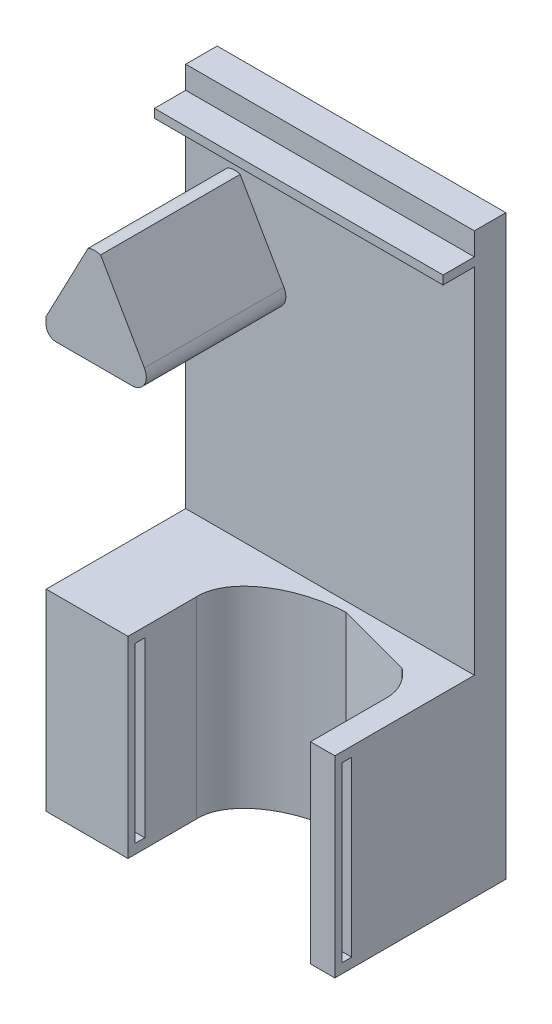
ISO-10303-21;
HEADER;
FILE_DESCRIPTION(('STEP AP214'),'2;1');
FILE_NAME('part.step','',(''),(''),'','','');
FILE_SCHEMA(('AUTOMOTIVE_DESIGN { 1 0 10303 214 1 1 1 1 }'));
ENDSEC;
DATA;
#1=APPLICATION_CONTEXT('core data for automotive mechanical design processes');
#2=APPLICATION_PROTOCOL_DEFINITION('international standard','automotive_design',2000,#1);
#3=PRODUCT_CONTEXT('',#1,'mechanical');
#4=PRODUCT('Part','Part','',(#3));
#5=PRODUCT_RELATED_PRODUCT_CATEGORY('part','',(#4));
#6=PRODUCT_DEFINITION_FORMATION('','',#4);
#7=PRODUCT_DEFINITION_CONTEXT('part definition',#1,'design');
#8=PRODUCT_DEFINITION('design','',#6,#7);
#9=PRODUCT_DEFINITION_SHAPE('','',#8);
#10=(LENGTH_UNIT() NAMED_UNIT(*) SI_UNIT(.MILLI.,.METRE.));
#11=(NAMED_UNIT(*) PLANE_ANGLE_UNIT() SI_UNIT($,.RADIAN.));
#12=(NAMED_UNIT(*) SI_UNIT($,.STERADIAN.) SOLID_ANGLE_UNIT());
#13=UNCERTAINTY_MEASURE_WITH_UNIT(LENGTH_MEASURE(1.E-05),#10,'distance_accuracy_value','');
#14=(GEOMETRIC_REPRESENTATION_CONTEXT(3) GLOBAL_UNCERTAINTY_ASSIGNED_CONTEXT((#13)) GLOBAL_UNIT_ASSIGNED_CONTEXT((#10,
#11,#12)) REPRESENTATION_CONTEXT('',''));
#15=CARTESIAN_POINT('',(0.,0.,0.));
#16=DIRECTION('',(0.,0.,1.));
#17=DIRECTION('',(1.,0.,0.));
#18=AXIS2_PLACEMENT_3D('',#15,#16,#17);
#19=CARTESIAN_POINT('',(0.,0.,6.54));
#20=DIRECTION('',(0.,0.,1.));
#21=DIRECTION('',(1.,0.,0.));
#22=AXIS2_PLACEMENT_3D('',#19,#20,#21);
#23=PLANE('',#22);
#24=DIRECTION('',(0.,1.,0.));
#25=VECTOR('',#24,1.);
#26=CARTESIAN_POINT('',(30.,60.,6.54));
#27=LINE('',#26,#25);
#28=CARTESIAN_POINT('',(30.,-20.,6.54));
#29=VERTEX_POINT('',#28);
#30=CARTESIAN_POINT('',(30.,53.5,6.54));
#31=VERTEX_POINT('',#30);
#32=EDGE_CURVE('E499',#29,#31,#27,.T.);
#33=ORIENTED_EDGE('',*,*,#32,.T.);
#34=DIRECTION('',(1.,0.,0.));
#35=VECTOR('',#34,1.);
#36=CARTESIAN_POINT('',(-30.,53.5,6.54));
#37=LINE('',#36,#35);
#38=CARTESIAN_POINT('',(-30.,53.5,6.54));
#39=VERTEX_POINT('',#38);
#40=EDGE_CURVE('E552',#39,#31,#37,.T.);
#41=ORIENTED_EDGE('',*,*,#40,.F.);
#42=DIRECTION('',(0.,-1.,0.));
#43=VECTOR('',#42,1.);
#44=CARTESIAN_POINT('',(-30.,60.,6.54));
#45=LINE('',#44,#43);
#46=CARTESIAN_POINT('',(-30.,29.1153741192558,6.54));
#47=VERTEX_POINT('',#46);
#48=EDGE_CURVE('E261',#39,#47,#45,.T.);
#49=ORIENTED_EDGE('',*,*,#48,.T.);
#50=DIRECTION('',(-0.464680084135932,-0.885478638594643,0.));
#51=VECTOR('',#50,1.);
#52=CARTESIAN_POINT('',(-21.2949868638054,45.7033524810124,6.54));
#53=LINE('',#52,#51);
#54=CARTESIAN_POINT('',(-21.2949868638054,45.7033524810124,6.54));
#55=VERTEX_POINT('',#54);
#56=EDGE_CURVE('E274',#55,#47,#53,.T.);
#57=ORIENTED_EDGE('',*,*,#56,.F.);
#58=CARTESIAN_POINT('',(-19.8396331656599,42.3250381747463,6.54));
#59=DIRECTION('',(0.,0.,1.));
#60=DIRECTION('',(-1.,0.,0.));
#61=AXIS2_PLACEMENT_3D('',#58,#59,#60);
#62=CIRCLE('',#61,3.67845917995946);
#63=CARTESIAN_POINT('',(-18.6840948980722,45.8172857677398,6.54));
#64=VERTEX_POINT('',#63);
#65=EDGE_CURVE('E284',#64,#55,#62,.T.);
#66=ORIENTED_EDGE('',*,*,#65,.F.);
#67=DIRECTION('',(-0.499150293138472,0.866515426786955,0.));
#68=VECTOR('',#67,1.);
#69=CARTESIAN_POINT('',(-7.,25.5339189814287,6.54));
#70=LINE('',#69,#68);
#71=CARTESIAN_POINT('',(-9.59072586065801,30.0313698608441,6.54));
#72=VERTEX_POINT('',#71);
#73=EDGE_CURVE('E265',#72,#64,#70,.T.);
#74=ORIENTED_EDGE('',*,*,#73,.F.);
#75=CARTESIAN_POINT('',(-12.1902721410189,28.5339189814287,6.54));
#76=DIRECTION('',(0.,0.,1.));
#77=DIRECTION('',(1.,0.,0.));
#78=AXIS2_PLACEMENT_3D('',#75,#76,#77);
#79=CIRCLE('',#78,3.);
#80=CARTESIAN_POINT('',(-12.1902721410189,25.5339189814287,6.54));
#81=VERTEX_POINT('',#80);
#82=EDGE_CURVE('E448',#72,#81,#79,.F.);
#83=ORIENTED_EDGE('',*,*,#82,.T.);
#84=DIRECTION('',(1.,0.,0.));
#85=VECTOR('',#84,1.);
#86=CARTESIAN_POINT('',(-30.,25.5339189814287,6.54));
#87=LINE('',#86,#85);
#88=CARTESIAN_POINT('',(-28.,25.5339189814287,6.54));
#89=VERTEX_POINT('',#88);
#90=EDGE_CURVE('E263',#89,#81,#87,.T.);
#91=ORIENTED_EDGE('',*,*,#90,.F.);
#92=CARTESIAN_POINT('',(-28.,27.5339189814287,6.54));
#93=DIRECTION('',(0.,0.,1.));
#94=DIRECTION('',(1.,0.,0.));
#95=AXIS2_PLACEMENT_3D('',#92,#93,#94);
#96=CIRCLE('',#95,2.);
#97=CARTESIAN_POINT('',(-30.,27.5339189814287,6.54));
#98=VERTEX_POINT('',#97);
#99=EDGE_CURVE('E12',#89,#98,#96,.F.);
#100=ORIENTED_EDGE('',*,*,#99,.T.);
#101=CARTESIAN_POINT('',(-30.,-20.,6.54));
#102=VERTEX_POINT('',#101);
#103=EDGE_CURVE('E51',#98,#102,#45,.T.);
#104=ORIENTED_EDGE('',*,*,#103,.T.);
#105=DIRECTION('',(-1.,0.,0.));
#106=VECTOR('',#105,1.);
#107=CARTESIAN_POINT('',(-30.,-20.,6.54));
#108=LINE('',#107,#106);
#109=EDGE_CURVE('E506',#29,#102,#108,.T.);
#110=ORIENTED_EDGE('',*,*,#109,.F.);
#111=EDGE_LOOP('',(#33,#41,#49,#57,#66,#74,#83,#91,#100,#104,#110));
#112=FACE_BOUND('',#111,.T.);
#113=ADVANCED_FACE('F36',(#112),#23,.T.);
#114=CARTESIAN_POINT('',(-30.,60.,6.54));
#115=VERTEX_POINT('',#114);
#116=CARTESIAN_POINT('',(-30.,55.3,6.54));
#117=VERTEX_POINT('',#116);
#118=EDGE_CURVE('E484',#115,#117,#45,.T.);
#119=ORIENTED_EDGE('',*,*,#118,.T.);
#120=DIRECTION('',(-1.,0.,0.));
#121=VECTOR('',#120,1.);
#122=CARTESIAN_POINT('',(-30.,55.3,6.54));
#123=LINE('',#122,#121);
#124=CARTESIAN_POINT('',(30.,55.3,6.54));
#125=VERTEX_POINT('',#124);
#126=EDGE_CURVE('E257',#125,#117,#123,.T.);
#127=ORIENTED_EDGE('',*,*,#126,.F.);
#128=CARTESIAN_POINT('',(30.,60.,6.54));
#129=VERTEX_POINT('',#128);
#130=EDGE_CURVE('E487',#125,#129,#27,.T.);
#131=ORIENTED_EDGE('',*,*,#130,.T.);
#132=DIRECTION('',(-1.,0.,0.));
#133=VECTOR('',#132,1.);
#134=CARTESIAN_POINT('',(-30.,60.,6.54));
#135=LINE('',#134,#133);
#136=EDGE_CURVE('E497',#129,#115,#135,.T.);
#137=ORIENTED_EDGE('',*,*,#136,.T.);
#138=EDGE_LOOP('',(#119,#127,#131,#137));
#139=FACE_BOUND('',#138,.T.);
#140=ADVANCED_FACE('F411',(#139),#23,.T.);
#141=CARTESIAN_POINT('',(-30.,-60.,6.54));
#142=DIRECTION('',(0.,1.,0.));
#143=DIRECTION('',(0.,0.,1.));
#144=AXIS2_PLACEMENT_3D('',#141,#142,#143);
#145=PLANE('',#144);
#146=DIRECTION('',(0.,0.,1.));
#147=VECTOR('',#146,1.);
#148=CARTESIAN_POINT('',(24.9445377,-60.,-0.001000000000001));
#149=LINE('',#148,#147);
#150=CARTESIAN_POINT('',(24.9445377,-60.,20.0760263546735));
#151=VERTEX_POINT('',#150);
#152=CARTESIAN_POINT('',(24.9445377,-60.,35.54));
#153=VERTEX_POINT('',#152);
#154=EDGE_CURVE('E373',#151,#153,#149,.T.);
#155=ORIENTED_EDGE('',*,*,#154,.F.);
#156=CARTESIAN_POINT('',(5.97226884999997,-60.,20.3091736323044));
#157=DIRECTION('',(0.,1.,0.));
#158=DIRECTION('',(0.998540465789473,0.,-0.0540086861619702));
#159=AXIS2_PLACEMENT_3D('',#156,#157,#158);
#160=ELLIPSE('',#159,19.,11.8);
#161=CARTESIAN_POINT('',(21.291300905005,-60.,12.8258124379132));
#162=VERTEX_POINT('',#161);
#163=EDGE_CURVE('E381',#162,#151,#160,.F.);
#164=ORIENTED_EDGE('',*,*,#163,.F.);
#165=DIRECTION('',(-0.96556287339124,0.,-0.260169824400239));
#166=VECTOR('',#165,1.);
#167=CARTESIAN_POINT('',(5.33496635328872,-60.,8.52639613598862));
#168=LINE('',#167,#166);
#169=CARTESIAN_POINT('',(5.33496635328871,-60.,8.52639613598862));
#170=VERTEX_POINT('',#169);
#171=EDGE_CURVE('E509',#162,#170,#168,.T.);
#172=ORIENTED_EDGE('',*,*,#171,.T.);
#173=CARTESIAN_POINT('',(-13.,-60.,21.3353386693828));
#174=VERTEX_POINT('',#173);
#175=EDGE_CURVE('E380',#174,#170,#160,.F.);
#176=ORIENTED_EDGE('',*,*,#175,.F.);
#177=DIRECTION('',(0.,0.,1.));
#178=VECTOR('',#177,1.);
#179=CARTESIAN_POINT('',(-13.,-60.,-0.001000000000001));
#180=LINE('',#179,#178);
#181=CARTESIAN_POINT('',(-13.,-60.,35.54));
#182=VERTEX_POINT('',#181);
#183=EDGE_CURVE('E370',#174,#182,#180,.T.);
#184=ORIENTED_EDGE('',*,*,#183,.T.);
#185=DIRECTION('',(1.,0.,0.));
#186=VECTOR('',#185,1.);
#187=CARTESIAN_POINT('',(-30.,-60.,35.54));
#188=LINE('',#187,#186);
#189=CARTESIAN_POINT('',(-30.,-60.,35.54));
#190=VERTEX_POINT('',#189);
#191=EDGE_CURVE('E515',#190,#182,#188,.T.);
#192=ORIENTED_EDGE('',*,*,#191,.F.);
#193=DIRECTION('',(0.,0.,-1.));
#194=VECTOR('',#193,1.);
#195=CARTESIAN_POINT('',(-30.,-60.,6.54));
#196=LINE('',#195,#194);
#197=CARTESIAN_POINT('',(-30.,-60.,0.));
#198=VERTEX_POINT('',#197);
#199=EDGE_CURVE('E478',#190,#198,#196,.T.);
#200=ORIENTED_EDGE('',*,*,#199,.T.);
#201=DIRECTION('',(1.,0.,0.));
#202=VECTOR('',#201,1.);
#203=CARTESIAN_POINT('',(-30.,-60.,0.));
#204=LINE('',#203,#202);
#205=CARTESIAN_POINT('',(30.,-60.,0.));
#206=VERTEX_POINT('',#205);
#207=EDGE_CURVE('E485',#198,#206,#204,.T.);
#208=ORIENTED_EDGE('',*,*,#207,.T.);
#209=DIRECTION('',(0.,0.,-1.));
#210=VECTOR('',#209,1.);
#211=CARTESIAN_POINT('',(30.,-60.,6.54));
#212=LINE('',#211,#210);
#213=CARTESIAN_POINT('',(30.,-60.,35.54));
#214=VERTEX_POINT('',#213);
#215=EDGE_CURVE('E481',#214,#206,#212,.T.);
#216=ORIENTED_EDGE('',*,*,#215,.F.);
#217=EDGE_CURVE('E518',#153,#214,#188,.T.);
#218=ORIENTED_EDGE('',*,*,#217,.F.);
#219=EDGE_LOOP('',(#155,#164,#172,#176,#184,#192,#200,#208,#216,#218));
#220=FACE_BOUND('',#219,.T.);
#221=ADVANCED_FACE('F407',(#220),#145,.F.);
#222=CARTESIAN_POINT('',(-30.,-20.,35.54));
#223=DIRECTION('',(0.,-1.,0.));
#224=DIRECTION('',(0.,0.,-1.));
#225=AXIS2_PLACEMENT_3D('',#222,#223,#224);
#226=PLANE('',#225);
#227=DIRECTION('',(0.,0.,1.));
#228=VECTOR('',#227,1.);
#229=CARTESIAN_POINT('',(24.9445377,-20.,-0.001000000000001));
#230=LINE('',#229,#228);
#231=CARTESIAN_POINT('',(24.9445377,-20.,20.0760263546737));
#232=VERTEX_POINT('',#231);
#233=CARTESIAN_POINT('',(24.9445377,-20.,35.54));
#234=VERTEX_POINT('',#233);
#235=EDGE_CURVE('E375',#232,#234,#230,.T.);
#236=ORIENTED_EDGE('',*,*,#235,.T.);
#237=DIRECTION('',(-1.,0.,0.));
#238=VECTOR('',#237,1.);
#239=CARTESIAN_POINT('',(-30.,-20.,35.54));
#240=LINE('',#239,#238);
#241=CARTESIAN_POINT('',(30.,-20.,35.54));
#242=VERTEX_POINT('',#241);
#243=EDGE_CURVE('E505',#242,#234,#240,.T.);
#244=ORIENTED_EDGE('',*,*,#243,.F.);
#245=DIRECTION('',(0.,0.,-1.));
#246=VECTOR('',#245,1.);
#247=CARTESIAN_POINT('',(30.,-20.,35.54));
#248=LINE('',#247,#246);
#249=EDGE_CURVE('E495',#242,#29,#248,.T.);
#250=ORIENTED_EDGE('',*,*,#249,.T.);
#251=ORIENTED_EDGE('',*,*,#109,.T.);
#252=DIRECTION('',(0.,0.,-1.));
#253=VECTOR('',#252,1.);
#254=CARTESIAN_POINT('',(-30.,-20.,35.54));
#255=LINE('',#254,#253);
#256=CARTESIAN_POINT('',(-30.,-20.,35.54));
#257=VERTEX_POINT('',#256);
#258=EDGE_CURVE('E503',#257,#102,#255,.T.);
#259=ORIENTED_EDGE('',*,*,#258,.F.);
#260=CARTESIAN_POINT('',(-13.,-20.,35.54));
#261=VERTEX_POINT('',#260);
#262=EDGE_CURVE('E512',#261,#257,#240,.T.);
#263=ORIENTED_EDGE('',*,*,#262,.F.);
#264=DIRECTION('',(0.,0.,1.));
#265=VECTOR('',#264,1.);
#266=CARTESIAN_POINT('',(-13.,-20.,-0.001000000000001));
#267=LINE('',#266,#265);
#268=CARTESIAN_POINT('',(-13.,-20.,21.3353386693828));
#269=VERTEX_POINT('',#268);
#270=EDGE_CURVE('E368',#269,#261,#267,.T.);
#271=ORIENTED_EDGE('',*,*,#270,.F.);
#272=CARTESIAN_POINT('',(5.97226884999997,-20.,20.3091736323044));
#273=DIRECTION('',(0.,1.,0.));
#274=DIRECTION('',(0.998540465789473,0.,-0.0540086861619702));
#275=AXIS2_PLACEMENT_3D('',#272,#273,#274);
#276=ELLIPSE('',#275,19.,11.8);
#277=CARTESIAN_POINT('',(5.33496635328872,-20.,8.52639613598862));
#278=VERTEX_POINT('',#277);
#279=EDGE_CURVE('E387',#278,#269,#276,.T.);
#280=ORIENTED_EDGE('',*,*,#279,.F.);
#281=DIRECTION('',(0.965562873391241,0.,0.260169824400239));
#282=VECTOR('',#281,1.);
#283=CARTESIAN_POINT('',(5.33496635328872,-20.,8.52639613598862));
#284=LINE('',#283,#282);
#285=CARTESIAN_POINT('',(21.291300905005,-20.,12.8258124379133));
#286=VERTEX_POINT('',#285);
#287=EDGE_CURVE('E527',#278,#286,#284,.T.);
#288=ORIENTED_EDGE('',*,*,#287,.T.);
#289=EDGE_CURVE('E384',#232,#286,#276,.T.);
#290=ORIENTED_EDGE('',*,*,#289,.F.);
#291=EDGE_LOOP('',(#236,#244,#250,#251,#259,#263,#271,#280,#288,#290));
#292=FACE_BOUND('',#291,.T.);
#293=ADVANCED_FACE('F404',(#292),#226,.F.);
#294=CARTESIAN_POINT('',(0.,0.,35.54));
#295=DIRECTION('',(0.,0.,1.));
#296=DIRECTION('',(1.,0.,0.));
#297=AXIS2_PLACEMENT_3D('',#294,#295,#296);
#298=PLANE('',#297);
#299=ORIENTED_EDGE('',*,*,#243,.T.);
#300=DIRECTION('',(0.,-1.,0.));
#301=VECTOR('',#300,1.);
#302=CARTESIAN_POINT('',(24.9445377,-20.,35.54));
#303=LINE('',#302,#301);
#304=EDGE_CURVE('E363',#234,#153,#303,.T.);
#305=ORIENTED_EDGE('',*,*,#304,.T.);
#306=ORIENTED_EDGE('',*,*,#217,.T.);
#307=DIRECTION('',(0.,1.,0.));
#308=VECTOR('',#307,1.);
#309=CARTESIAN_POINT('',(30.,-20.,35.54));
#310=LINE('',#309,#308);
#311=EDGE_CURVE('E513',#214,#242,#310,.T.);
#312=ORIENTED_EDGE('',*,*,#311,.T.);
#313=EDGE_LOOP('',(#299,#305,#306,#312));
#314=FACE_BOUND('',#313,.T.);
#315=ADVANCED_FACE('F403',(#314),#298,.T.);
#316=CARTESIAN_POINT('',(5.97226884999997,-60.001,20.3091736323044));
#317=DIRECTION('',(0.,1.,0.));
#318=DIRECTION('',(0.998540465789473,0.,-0.0540086861619702));
#319=AXIS2_PLACEMENT_3D('',#316,#317,#318);
#320=ELLIPSE('',#319,19.,11.8);
#321=DIRECTION('',(0.,1.,0.));
#322=VECTOR('',#321,1.);
#323=SURFACE_OF_LINEAR_EXTRUSION('',#320,#322);
#324=DIRECTION('',(0.,1.,0.));
#325=VECTOR('',#324,1.);
#326=CARTESIAN_POINT('',(24.9445377,-40.,20.0760263546737));
#327=LINE('',#326,#325);
#328=EDGE_CURVE('E354',#151,#232,#327,.T.);
#329=ORIENTED_EDGE('',*,*,#328,.T.);
#330=ORIENTED_EDGE('',*,*,#289,.T.);
#331=DIRECTION('',(0.,1.,0.));
#332=VECTOR('',#331,1.);
#333=CARTESIAN_POINT('',(21.291300905005,-60.001,12.8258124379132));
#334=LINE('',#333,#332);
#335=EDGE_CURVE('E524',#162,#286,#334,.T.);
#336=ORIENTED_EDGE('',*,*,#335,.F.);
#337=ORIENTED_EDGE('',*,*,#163,.T.);
#338=EDGE_LOOP('',(#329,#330,#336,#337));
#339=FACE_BOUND('',#338,.T.);
#340=ADVANCED_FACE('F397',(#339),#323,.F.);
#341=CARTESIAN_POINT('',(30.,60.,6.54));
#342=DIRECTION('',(-1.,0.,0.));
#343=DIRECTION('',(0.,-1.,0.));
#344=AXIS2_PLACEMENT_3D('',#341,#342,#343);
#345=PLANE('',#344);
#346=DIRECTION('',(0.,0.,-1.));
#347=VECTOR('',#346,1.);
#348=CARTESIAN_POINT('',(30.,-22.,6.54));
#349=LINE('',#348,#347);
#350=CARTESIAN_POINT('',(30.,-22.,34.04));
#351=VERTEX_POINT('',#350);
#352=CARTESIAN_POINT('',(30.,-22.,32.04));
#353=VERTEX_POINT('',#352);
#354=EDGE_CURVE('E322',#351,#353,#349,.T.);
#355=ORIENTED_EDGE('',*,*,#354,.T.);
#356=DIRECTION('',(0.,-1.,0.));
#357=VECTOR('',#356,1.);
#358=CARTESIAN_POINT('',(30.,60.,32.04));
#359=LINE('',#358,#357);
#360=CARTESIAN_POINT('',(30.,-58.,32.04));
#361=VERTEX_POINT('',#360);
#362=EDGE_CURVE('E325',#353,#361,#359,.T.);
#363=ORIENTED_EDGE('',*,*,#362,.T.);
#364=DIRECTION('',(0.,0.,1.));
#365=VECTOR('',#364,1.);
#366=CARTESIAN_POINT('',(30.,-57.9999999999999,6.53999999999959));
#367=LINE('',#366,#365);
#368=CARTESIAN_POINT('',(30.,-58.,34.04));
#369=VERTEX_POINT('',#368);
#370=EDGE_CURVE('E310',#361,#369,#367,.T.);
#371=ORIENTED_EDGE('',*,*,#370,.T.);
#372=DIRECTION('',(0.,1.,0.));
#373=VECTOR('',#372,1.);
#374=CARTESIAN_POINT('',(30.,60.,34.04));
#375=LINE('',#374,#373);
#376=EDGE_CURVE('E319',#369,#351,#375,.T.);
#377=ORIENTED_EDGE('',*,*,#376,.T.);
#378=EDGE_LOOP('',(#355,#363,#371,#377));
#379=FACE_BOUND('',#378,.T.);
#380=DIRECTION('',(0.,1.,0.));
#381=VECTOR('',#380,1.);
#382=CARTESIAN_POINT('',(30.,60.,0.));
#383=LINE('',#382,#381);
#384=CARTESIAN_POINT('',(30.,60.,0.));
#385=VERTEX_POINT('',#384);
#386=EDGE_CURVE('E492',#206,#385,#383,.T.);
#387=ORIENTED_EDGE('',*,*,#386,.T.);
#388=DIRECTION('',(0.,0.,-1.));
#389=VECTOR('',#388,1.);
#390=CARTESIAN_POINT('',(30.,60.,6.54));
#391=LINE('',#390,#389);
#392=EDGE_CURVE('E471',#129,#385,#391,.T.);
#393=ORIENTED_EDGE('',*,*,#392,.F.);
#394=ORIENTED_EDGE('',*,*,#130,.F.);
#395=DIRECTION('',(0.,0.,-1.));
#396=VECTOR('',#395,1.);
#397=CARTESIAN_POINT('',(30.,55.3,13.04));
#398=LINE('',#397,#396);
#399=CARTESIAN_POINT('',(30.,55.3,13.04));
#400=VERTEX_POINT('',#399);
#401=EDGE_CURVE('E267',#400,#125,#398,.T.);
#402=ORIENTED_EDGE('',*,*,#401,.F.);
#403=DIRECTION('',(0.,1.,0.));
#404=VECTOR('',#403,1.);
#405=CARTESIAN_POINT('',(30.,55.3,13.04));
#406=LINE('',#405,#404);
#407=CARTESIAN_POINT('',(30.,53.5,13.04));
#408=VERTEX_POINT('',#407);
#409=EDGE_CURVE('E248',#408,#400,#406,.T.);
#410=ORIENTED_EDGE('',*,*,#409,.F.);
#411=DIRECTION('',(0.,0.,-1.));
#412=VECTOR('',#411,1.);
#413=CARTESIAN_POINT('',(30.,53.5,13.04));
#414=LINE('',#413,#412);
#415=EDGE_CURVE('E245',#408,#31,#414,.T.);
#416=ORIENTED_EDGE('',*,*,#415,.T.);
#417=ORIENTED_EDGE('',*,*,#32,.F.);
#418=ORIENTED_EDGE('',*,*,#249,.F.);
#419=ORIENTED_EDGE('',*,*,#311,.F.);
#420=ORIENTED_EDGE('',*,*,#215,.T.);
#421=EDGE_LOOP('',(#387,#393,#394,#402,#410,#416,#417,#418,#419,#420));
#422=FACE_BOUND('',#421,.T.);
#423=ADVANCED_FACE('F424',(#379,#422),#345,.F.);
#424=CARTESIAN_POINT('',(-30.,60.,6.54));
#425=DIRECTION('',(0.,-1.,0.));
#426=DIRECTION('',(0.,0.,-1.));
#427=AXIS2_PLACEMENT_3D('',#424,#425,#426);
#428=PLANE('',#427);
#429=DIRECTION('',(-1.,0.,0.));
#430=VECTOR('',#429,1.);
#431=CARTESIAN_POINT('',(-30.,60.,0.));
#432=LINE('',#431,#430);
#433=CARTESIAN_POINT('',(-30.,60.,0.));
#434=VERTEX_POINT('',#433);
#435=EDGE_CURVE('E490',#385,#434,#432,.T.);
#436=ORIENTED_EDGE('',*,*,#435,.T.);
#437=DIRECTION('',(0.,0.,-1.));
#438=VECTOR('',#437,1.);
#439=CARTESIAN_POINT('',(-30.,60.,6.54));
#440=LINE('',#439,#438);
#441=EDGE_CURVE('E473',#115,#434,#440,.T.);
#442=ORIENTED_EDGE('',*,*,#441,.F.);
#443=ORIENTED_EDGE('',*,*,#136,.F.);
#444=ORIENTED_EDGE('',*,*,#392,.T.);
#445=EDGE_LOOP('',(#436,#442,#443,#444));
#446=FACE_BOUND('',#445,.T.);
#447=ADVANCED_FACE('F421',(#446),#428,.F.);
#448=CARTESIAN_POINT('',(-30.,60.,6.54));
#449=DIRECTION('',(1.,0.,0.));
#450=DIRECTION('',(0.,1.,0.));
#451=AXIS2_PLACEMENT_3D('',#448,#449,#450);
#452=PLANE('',#451);
#453=ORIENTED_EDGE('',*,*,#103,.F.);
#454=DIRECTION('',(0.,0.,-1.));
#455=VECTOR('',#454,1.);
#456=CARTESIAN_POINT('',(-30.,27.5339189814287,6.54));
#457=LINE('',#456,#455);
#458=CARTESIAN_POINT('',(-30.,27.5339189814287,35.54));
#459=VERTEX_POINT('',#458);
#460=EDGE_CURVE('E55',#98,#459,#457,.F.);
#461=ORIENTED_EDGE('',*,*,#460,.T.);
#462=DIRECTION('',(0.,-1.,0.));
#463=VECTOR('',#462,1.);
#464=CARTESIAN_POINT('',(-30.,29.1153741192558,35.54));
#465=LINE('',#464,#463);
#466=CARTESIAN_POINT('',(-30.,29.1153741192558,35.54));
#467=VERTEX_POINT('',#466);
#468=EDGE_CURVE('E280',#467,#459,#465,.T.);
#469=ORIENTED_EDGE('',*,*,#468,.F.);
#470=DIRECTION('',(0.,0.,-1.));
#471=VECTOR('',#470,1.);
#472=CARTESIAN_POINT('',(-30.,29.1153741192558,35.54));
#473=LINE('',#472,#471);
#474=EDGE_CURVE('E281',#467,#47,#473,.T.);
#475=ORIENTED_EDGE('',*,*,#474,.T.);
#476=ORIENTED_EDGE('',*,*,#48,.F.);
#477=DIRECTION('',(0.,0.,-1.));
#478=VECTOR('',#477,1.);
#479=CARTESIAN_POINT('',(-30.,53.5,13.04));
#480=LINE('',#479,#478);
#481=CARTESIAN_POINT('',(-30.,53.5,13.04));
#482=VERTEX_POINT('',#481);
#483=EDGE_CURVE('E243',#482,#39,#480,.T.);
#484=ORIENTED_EDGE('',*,*,#483,.F.);
#485=DIRECTION('',(0.,-1.,0.));
#486=VECTOR('',#485,1.);
#487=CARTESIAN_POINT('',(-30.,55.3,13.04));
#488=LINE('',#487,#486);
#489=CARTESIAN_POINT('',(-30.,55.3,13.04));
#490=VERTEX_POINT('',#489);
#491=EDGE_CURVE('E249',#490,#482,#488,.T.);
#492=ORIENTED_EDGE('',*,*,#491,.F.);
#493=DIRECTION('',(0.,0.,-1.));
#494=VECTOR('',#493,1.);
#495=CARTESIAN_POINT('',(-30.,55.3,13.04));
#496=LINE('',#495,#494);
#497=EDGE_CURVE('E559',#490,#117,#496,.T.);
#498=ORIENTED_EDGE('',*,*,#497,.T.);
#499=ORIENTED_EDGE('',*,*,#118,.F.);
#500=ORIENTED_EDGE('',*,*,#441,.T.);
#501=DIRECTION('',(0.,-1.,0.));
#502=VECTOR('',#501,1.);
#503=CARTESIAN_POINT('',(-30.,60.,0.));
#504=LINE('',#503,#502);
#505=EDGE_CURVE('E488',#434,#198,#504,.T.);
#506=ORIENTED_EDGE('',*,*,#505,.T.);
#507=ORIENTED_EDGE('',*,*,#199,.F.);
#508=DIRECTION('',(0.,-1.,0.));
#509=VECTOR('',#508,1.);
#510=CARTESIAN_POINT('',(-30.,-20.,35.54));
#511=LINE('',#510,#509);
#512=EDGE_CURVE('E508',#257,#190,#511,.T.);
#513=ORIENTED_EDGE('',*,*,#512,.F.);
#514=ORIENTED_EDGE('',*,*,#258,.T.);
#515=EDGE_LOOP('',(#453,#461,#469,#475,#476,#484,#492,#498,#499,#500,#506,#507,#513,#514));
#516=FACE_BOUND('',#515,.T.);
#517=ADVANCED_FACE('F259',(#516),#452,.F.);
#518=CARTESIAN_POINT('',(0.,0.,0.));
#519=DIRECTION('',(0.,0.,1.));
#520=DIRECTION('',(1.,0.,0.));
#521=AXIS2_PLACEMENT_3D('',#518,#519,#520);
#522=PLANE('',#521);
#523=ORIENTED_EDGE('',*,*,#386,.F.);
#524=ORIENTED_EDGE('',*,*,#207,.F.);
#525=ORIENTED_EDGE('',*,*,#505,.F.);
#526=ORIENTED_EDGE('',*,*,#435,.F.);
#527=EDGE_LOOP('',(#523,#524,#525,#526));
#528=FACE_BOUND('',#527,.T.);
#529=ADVANCED_FACE('F401',(#528),#522,.F.);
#530=DIRECTION('',(0.,-1.,0.));
#531=VECTOR('',#530,1.);
#532=CARTESIAN_POINT('',(-13.,-20.,35.54));
#533=LINE('',#532,#531);
#534=EDGE_CURVE('E366',#261,#182,#533,.T.);
#535=ORIENTED_EDGE('',*,*,#534,.F.);
#536=ORIENTED_EDGE('',*,*,#262,.T.);
#537=ORIENTED_EDGE('',*,*,#512,.T.);
#538=ORIENTED_EDGE('',*,*,#191,.T.);
#539=EDGE_LOOP('',(#535,#536,#537,#538));
#540=FACE_BOUND('',#539,.T.);
#541=ADVANCED_FACE('F395',(#540),#298,.T.);
#542=ORIENTED_EDGE('',*,*,#279,.T.);
#543=DIRECTION('',(0.,1.,0.));
#544=VECTOR('',#543,1.);
#545=CARTESIAN_POINT('',(-13.,-40.,21.3353386693828));
#546=LINE('',#545,#544);
#547=EDGE_CURVE('E378',#174,#269,#546,.T.);
#548=ORIENTED_EDGE('',*,*,#547,.F.);
#549=ORIENTED_EDGE('',*,*,#175,.T.);
#550=DIRECTION('',(0.,1.,0.));
#551=VECTOR('',#550,1.);
#552=CARTESIAN_POINT('',(5.33496635328872,-60.001,8.52639613598862));
#553=LINE('',#552,#551);
#554=EDGE_CURVE('E523',#170,#278,#553,.T.);
#555=ORIENTED_EDGE('',*,*,#554,.T.);
#556=EDGE_LOOP('',(#542,#548,#549,#555));
#557=FACE_BOUND('',#556,.T.);
#558=ADVANCED_FACE('F390',(#557),#323,.F.);
#559=CARTESIAN_POINT('',(5.33496635328872,-60.001,8.52639613598862));
#560=DIRECTION('',(-0.260169824400239,0.,0.96556287339124));
#561=DIRECTION('',(0.96556287339124,0.,0.260169824400239));
#562=AXIS2_PLACEMENT_3D('',#559,#560,#561);
#563=PLANE('',#562);
#564=ORIENTED_EDGE('',*,*,#335,.T.);
#565=ORIENTED_EDGE('',*,*,#287,.F.);
#566=ORIENTED_EDGE('',*,*,#554,.F.);
#567=ORIENTED_EDGE('',*,*,#171,.F.);
#568=EDGE_LOOP('',(#564,#565,#566,#567));
#569=FACE_BOUND('',#568,.T.);
#570=ADVANCED_FACE('F394',(#569),#563,.T.);
#571=CARTESIAN_POINT('',(-13.,-20.,-0.001000000000001));
#572=DIRECTION('',(-1.,0.,0.));
#573=DIRECTION('',(0.,-1.,0.));
#574=AXIS2_PLACEMENT_3D('',#571,#572,#573);
#575=PLANE('',#574);
#576=DIRECTION('',(0.,0.,-1.));
#577=VECTOR('',#576,1.);
#578=CARTESIAN_POINT('',(-13.,-58.,34.04));
#579=LINE('',#578,#577);
#580=CARTESIAN_POINT('',(-13.,-58.,34.04));
#581=VERTEX_POINT('',#580);
#582=CARTESIAN_POINT('',(-13.,-58.,32.04));
#583=VERTEX_POINT('',#582);
#584=EDGE_CURVE('E344',#581,#583,#579,.T.);
#585=ORIENTED_EDGE('',*,*,#584,.F.);
#586=DIRECTION('',(0.,-1.,0.));
#587=VECTOR('',#586,1.);
#588=CARTESIAN_POINT('',(-13.,-22.,34.04));
#589=LINE('',#588,#587);
#590=CARTESIAN_POINT('',(-13.,-22.,34.04));
#591=VERTEX_POINT('',#590);
#592=EDGE_CURVE('E328',#591,#581,#589,.T.);
#593=ORIENTED_EDGE('',*,*,#592,.F.);
#594=DIRECTION('',(0.,0.,1.));
#595=VECTOR('',#594,1.);
#596=CARTESIAN_POINT('',(-13.,-22.,34.04));
#597=LINE('',#596,#595);
#598=CARTESIAN_POINT('',(-13.,-22.,32.04));
#599=VERTEX_POINT('',#598);
#600=EDGE_CURVE('E333',#599,#591,#597,.T.);
#601=ORIENTED_EDGE('',*,*,#600,.F.);
#602=DIRECTION('',(0.,1.,0.));
#603=VECTOR('',#602,1.);
#604=CARTESIAN_POINT('',(-13.,-22.,32.04));
#605=LINE('',#604,#603);
#606=EDGE_CURVE('E347',#583,#599,#605,.T.);
#607=ORIENTED_EDGE('',*,*,#606,.F.);
#608=EDGE_LOOP('',(#585,#593,#601,#607));
#609=FACE_BOUND('',#608,.T.);
#610=ORIENTED_EDGE('',*,*,#547,.T.);
#611=ORIENTED_EDGE('',*,*,#270,.T.);
#612=ORIENTED_EDGE('',*,*,#534,.T.);
#613=ORIENTED_EDGE('',*,*,#183,.F.);
#614=EDGE_LOOP('',(#610,#611,#612,#613));
#615=FACE_BOUND('',#614,.T.);
#616=ADVANCED_FACE('F578',(#609,#615),#575,.F.);
#617=CARTESIAN_POINT('',(24.9445377,-20.,-0.001000000000001));
#618=DIRECTION('',(-1.,0.,0.));
#619=DIRECTION('',(0.,-1.,0.));
#620=AXIS2_PLACEMENT_3D('',#617,#618,#619);
#621=PLANE('',#620);
#622=DIRECTION('',(0.,-1.,0.));
#623=VECTOR('',#622,1.);
#624=CARTESIAN_POINT('',(24.9445377,-22.,32.04));
#625=LINE('',#624,#623);
#626=CARTESIAN_POINT('',(24.9445377,-22.,32.04));
#627=VERTEX_POINT('',#626);
#628=CARTESIAN_POINT('',(24.9445377,-58.,32.04));
#629=VERTEX_POINT('',#628);
#630=EDGE_CURVE('E296',#627,#629,#625,.T.);
#631=ORIENTED_EDGE('',*,*,#630,.F.);
#632=DIRECTION('',(0.,0.,-1.));
#633=VECTOR('',#632,1.);
#634=CARTESIAN_POINT('',(24.9445377,-22.,32.04));
#635=LINE('',#634,#633);
#636=CARTESIAN_POINT('',(24.9445377,-22.,34.04));
#637=VERTEX_POINT('',#636);
#638=EDGE_CURVE('E304',#637,#627,#635,.T.);
#639=ORIENTED_EDGE('',*,*,#638,.F.);
#640=DIRECTION('',(0.,1.,0.));
#641=VECTOR('',#640,1.);
#642=CARTESIAN_POINT('',(24.9445377,-22.,34.04));
#643=LINE('',#642,#641);
#644=CARTESIAN_POINT('',(24.9445377,-58.,34.04));
#645=VERTEX_POINT('',#644);
#646=EDGE_CURVE('E301',#645,#637,#643,.T.);
#647=ORIENTED_EDGE('',*,*,#646,.F.);
#648=DIRECTION('',(0.,0.,1.));
#649=VECTOR('',#648,1.);
#650=CARTESIAN_POINT('',(24.9445377,-58.,32.04));
#651=LINE('',#650,#649);
#652=EDGE_CURVE('E298',#629,#645,#651,.T.);
#653=ORIENTED_EDGE('',*,*,#652,.F.);
#654=EDGE_LOOP('',(#631,#639,#647,#653));
#655=FACE_BOUND('',#654,.T.);
#656=ORIENTED_EDGE('',*,*,#154,.T.);
#657=ORIENTED_EDGE('',*,*,#304,.F.);
#658=ORIENTED_EDGE('',*,*,#235,.F.);
#659=ORIENTED_EDGE('',*,*,#328,.F.);
#660=EDGE_LOOP('',(#656,#657,#658,#659));
#661=FACE_BOUND('',#660,.T.);
#662=ADVANCED_FACE('F544',(#655,#661),#621,.T.);
#663=CARTESIAN_POINT('',(-22.,-22.,34.04));
#664=DIRECTION('',(0.,0.,1.));
#665=DIRECTION('',(0.,-1.,0.));
#666=AXIS2_PLACEMENT_3D('',#663,#664,#665);
#667=PLANE('',#666);
#668=ORIENTED_EDGE('',*,*,#592,.T.);
#669=DIRECTION('',(1.,0.,0.));
#670=VECTOR('',#669,1.);
#671=CARTESIAN_POINT('',(-22.,-58.,34.04));
#672=LINE('',#671,#670);
#673=CARTESIAN_POINT('',(-22.,-58.,34.04));
#674=VERTEX_POINT('',#673);
#675=EDGE_CURVE('E342',#674,#581,#672,.T.);
#676=ORIENTED_EDGE('',*,*,#675,.F.);
#677=DIRECTION('',(0.,-1.,0.));
#678=VECTOR('',#677,1.);
#679=CARTESIAN_POINT('',(-22.,-22.,34.04));
#680=LINE('',#679,#678);
#681=CARTESIAN_POINT('',(-22.,-22.,34.04));
#682=VERTEX_POINT('',#681);
#683=EDGE_CURVE('E329',#682,#674,#680,.T.);
#684=ORIENTED_EDGE('',*,*,#683,.F.);
#685=DIRECTION('',(1.,0.,0.));
#686=VECTOR('',#685,1.);
#687=CARTESIAN_POINT('',(-22.,-22.,34.04));
#688=LINE('',#687,#686);
#689=EDGE_CURVE('E352',#682,#591,#688,.T.);
#690=ORIENTED_EDGE('',*,*,#689,.T.);
#691=EDGE_LOOP('',(#668,#676,#684,#690));
#692=FACE_BOUND('',#691,.T.);
#693=ADVANCED_FACE('F586',(#692),#667,.F.);
#694=CARTESIAN_POINT('',(-22.,-22.,34.04));
#695=DIRECTION('',(0.,1.,0.));
#696=DIRECTION('',(-1.,0.,0.));
#697=AXIS2_PLACEMENT_3D('',#694,#695,#696);
#698=PLANE('',#697);
#699=ORIENTED_EDGE('',*,*,#600,.T.);
#700=ORIENTED_EDGE('',*,*,#689,.F.);
#701=DIRECTION('',(0.,0.,1.));
#702=VECTOR('',#701,1.);
#703=CARTESIAN_POINT('',(-22.,-22.,34.04));
#704=LINE('',#703,#702);
#705=CARTESIAN_POINT('',(-22.,-22.,32.04));
#706=VERTEX_POINT('',#705);
#707=EDGE_CURVE('E339',#706,#682,#704,.T.);
#708=ORIENTED_EDGE('',*,*,#707,.F.);
#709=DIRECTION('',(1.,0.,0.));
#710=VECTOR('',#709,1.);
#711=CARTESIAN_POINT('',(-22.,-22.,32.04));
#712=LINE('',#711,#710);
#713=EDGE_CURVE('E355',#706,#599,#712,.T.);
#714=ORIENTED_EDGE('',*,*,#713,.T.);
#715=EDGE_LOOP('',(#699,#700,#708,#714));
#716=FACE_BOUND('',#715,.T.);
#717=ADVANCED_FACE('F592',(#716),#698,.F.);
#718=CARTESIAN_POINT('',(-22.,-22.,32.04));
#719=DIRECTION('',(0.,0.,-1.));
#720=DIRECTION('',(0.,1.,0.));
#721=AXIS2_PLACEMENT_3D('',#718,#719,#720);
#722=PLANE('',#721);
#723=ORIENTED_EDGE('',*,*,#606,.T.);
#724=ORIENTED_EDGE('',*,*,#713,.F.);
#725=DIRECTION('',(0.,1.,0.));
#726=VECTOR('',#725,1.);
#727=CARTESIAN_POINT('',(-22.,-22.,32.04));
#728=LINE('',#727,#726);
#729=CARTESIAN_POINT('',(-22.,-58.,32.04));
#730=VERTEX_POINT('',#729);
#731=EDGE_CURVE('E336',#730,#706,#728,.T.);
#732=ORIENTED_EDGE('',*,*,#731,.F.);
#733=DIRECTION('',(1.,0.,0.));
#734=VECTOR('',#733,1.);
#735=CARTESIAN_POINT('',(-22.,-58.,32.04));
#736=LINE('',#735,#734);
#737=EDGE_CURVE('E357',#730,#583,#736,.T.);
#738=ORIENTED_EDGE('',*,*,#737,.T.);
#739=EDGE_LOOP('',(#723,#724,#732,#738));
#740=FACE_BOUND('',#739,.T.);
#741=ADVANCED_FACE('F598',(#740),#722,.F.);
#742=CARTESIAN_POINT('',(-22.,-58.,34.04));
#743=DIRECTION('',(0.,-1.,0.));
#744=DIRECTION('',(0.,0.,-1.));
#745=AXIS2_PLACEMENT_3D('',#742,#743,#744);
#746=PLANE('',#745);
#747=ORIENTED_EDGE('',*,*,#584,.T.);
#748=ORIENTED_EDGE('',*,*,#737,.F.);
#749=DIRECTION('',(0.,0.,-1.));
#750=VECTOR('',#749,1.);
#751=CARTESIAN_POINT('',(-22.,-58.,34.04));
#752=LINE('',#751,#750);
#753=EDGE_CURVE('E332',#674,#730,#752,.T.);
#754=ORIENTED_EDGE('',*,*,#753,.F.);
#755=ORIENTED_EDGE('',*,*,#675,.T.);
#756=EDGE_LOOP('',(#747,#748,#754,#755));
#757=FACE_BOUND('',#756,.T.);
#758=ADVANCED_FACE('F594',(#757),#746,.F.);
#759=CARTESIAN_POINT('',(-22.,0.,0.));
#760=DIRECTION('',(1.,0.,0.));
#761=DIRECTION('',(0.,1.,0.));
#762=AXIS2_PLACEMENT_3D('',#759,#760,#761);
#763=PLANE('',#762);
#764=ORIENTED_EDGE('',*,*,#683,.T.);
#765=ORIENTED_EDGE('',*,*,#753,.T.);
#766=ORIENTED_EDGE('',*,*,#731,.T.);
#767=ORIENTED_EDGE('',*,*,#707,.T.);
#768=EDGE_LOOP('',(#764,#765,#766,#767));
#769=FACE_BOUND('',#768,.T.);
#770=ADVANCED_FACE('F597',(#769),#763,.T.);
#771=CARTESIAN_POINT('',(33.9445377,-22.,32.04));
#772=DIRECTION('',(0.,0.,-1.));
#773=DIRECTION('',(0.,1.,0.));
#774=AXIS2_PLACEMENT_3D('',#771,#772,#773);
#775=PLANE('',#774);
#776=DIRECTION('',(-1.,0.,0.));
#777=VECTOR('',#776,1.);
#778=CARTESIAN_POINT('',(33.9445377,-22.,32.04));
#779=LINE('',#778,#777);
#780=EDGE_CURVE('E308',#353,#627,#779,.T.);
#781=ORIENTED_EDGE('',*,*,#780,.T.);
#782=ORIENTED_EDGE('',*,*,#630,.T.);
#783=DIRECTION('',(-1.,0.,0.));
#784=VECTOR('',#783,1.);
#785=CARTESIAN_POINT('',(33.9445377,-58.,32.04));
#786=LINE('',#785,#784);
#787=EDGE_CURVE('E307',#361,#629,#786,.T.);
#788=ORIENTED_EDGE('',*,*,#787,.F.);
#789=ORIENTED_EDGE('',*,*,#362,.F.);
#790=EDGE_LOOP('',(#781,#782,#788,#789));
#791=FACE_BOUND('',#790,.T.);
#792=ADVANCED_FACE('F608',(#791),#775,.F.);
#793=CARTESIAN_POINT('',(33.9445377,-22.,32.04));
#794=DIRECTION('',(0.,1.,0.));
#795=DIRECTION('',(-1.,0.,0.));
#796=AXIS2_PLACEMENT_3D('',#793,#794,#795);
#797=PLANE('',#796);
#798=DIRECTION('',(-1.,0.,0.));
#799=VECTOR('',#798,1.);
#800=CARTESIAN_POINT('',(33.9445377,-22.,34.04));
#801=LINE('',#800,#799);
#802=EDGE_CURVE('E311',#351,#637,#801,.T.);
#803=ORIENTED_EDGE('',*,*,#802,.T.);
#804=ORIENTED_EDGE('',*,*,#638,.T.);
#805=ORIENTED_EDGE('',*,*,#780,.F.);
#806=ORIENTED_EDGE('',*,*,#354,.F.);
#807=EDGE_LOOP('',(#803,#804,#805,#806));
#808=FACE_BOUND('',#807,.T.);
#809=ADVANCED_FACE('F612',(#808),#797,.F.);
#810=CARTESIAN_POINT('',(33.9445377,-22.,34.04));
#811=DIRECTION('',(0.,0.,1.));
#812=DIRECTION('',(0.,-1.,0.));
#813=AXIS2_PLACEMENT_3D('',#810,#811,#812);
#814=PLANE('',#813);
#815=DIRECTION('',(-1.,0.,0.));
#816=VECTOR('',#815,1.);
#817=CARTESIAN_POINT('',(33.9445377,-58.,34.04));
#818=LINE('',#817,#816);
#819=EDGE_CURVE('E313',#369,#645,#818,.T.);
#820=ORIENTED_EDGE('',*,*,#819,.T.);
#821=ORIENTED_EDGE('',*,*,#646,.T.);
#822=ORIENTED_EDGE('',*,*,#802,.F.);
#823=ORIENTED_EDGE('',*,*,#376,.F.);
#824=EDGE_LOOP('',(#820,#821,#822,#823));
#825=FACE_BOUND('',#824,.T.);
#826=ADVANCED_FACE('F617',(#825),#814,.F.);
#827=CARTESIAN_POINT('',(33.9445377,-58.,32.04));
#828=DIRECTION('',(0.,-1.,0.));
#829=DIRECTION('',(0.,0.,-1.));
#830=AXIS2_PLACEMENT_3D('',#827,#828,#829);
#831=PLANE('',#830);
#832=ORIENTED_EDGE('',*,*,#787,.T.);
#833=ORIENTED_EDGE('',*,*,#652,.T.);
#834=ORIENTED_EDGE('',*,*,#819,.F.);
#835=ORIENTED_EDGE('',*,*,#370,.F.);
#836=EDGE_LOOP('',(#832,#833,#834,#835));
#837=FACE_BOUND('',#836,.T.);
#838=ADVANCED_FACE('F614',(#837),#831,.F.);
#839=CARTESIAN_POINT('',(-30.,25.5339189814287,35.54));
#840=DIRECTION('',(0.,1.,0.));
#841=DIRECTION('',(0.,0.,1.));
#842=AXIS2_PLACEMENT_3D('',#839,#840,#841);
#843=PLANE('',#842);
#844=DIRECTION('',(1.,0.,0.));
#845=VECTOR('',#844,1.);
#846=CARTESIAN_POINT('',(-30.,25.5339189814287,35.54));
#847=LINE('',#846,#845);
#848=CARTESIAN_POINT('',(-28.,25.5339189814287,35.54));
#849=VERTEX_POINT('',#848);
#850=CARTESIAN_POINT('',(-12.1902721410189,25.5339189814287,35.54));
#851=VERTEX_POINT('',#850);
#852=EDGE_CURVE('E271',#849,#851,#847,.T.);
#853=ORIENTED_EDGE('',*,*,#852,.F.);
#854=DIRECTION('',(0.,0.,-1.));
#855=VECTOR('',#854,1.);
#856=CARTESIAN_POINT('',(-28.,25.5339189814287,35.54));
#857=LINE('',#856,#855);
#858=EDGE_CURVE('E451',#849,#89,#857,.T.);
#859=ORIENTED_EDGE('',*,*,#858,.T.);
#860=ORIENTED_EDGE('',*,*,#90,.T.);
#861=DIRECTION('',(0.,0.,-1.));
#862=VECTOR('',#861,1.);
#863=CARTESIAN_POINT('',(-12.1902721410189,25.5339189814287,35.54));
#864=LINE('',#863,#862);
#865=EDGE_CURVE('E443',#81,#851,#864,.F.);
#866=ORIENTED_EDGE('',*,*,#865,.T.);
#867=EDGE_LOOP('',(#853,#859,#860,#866));
#868=FACE_BOUND('',#867,.T.);
#869=ADVANCED_FACE('F463',(#868),#843,.F.);
#870=CARTESIAN_POINT('',(-7.,25.5339189814287,35.54));
#871=DIRECTION('',(-0.866515426786955,-0.499150293138472,0.));
#872=DIRECTION('',(0.499150293138472,-0.866515426786955,0.));
#873=AXIS2_PLACEMENT_3D('',#870,#871,#872);
#874=PLANE('',#873);
#875=DIRECTION('',(-0.499150293138472,0.866515426786955,0.));
#876=VECTOR('',#875,1.);
#877=CARTESIAN_POINT('',(-7.,25.5339189814287,35.54));
#878=LINE('',#877,#876);
#879=CARTESIAN_POINT('',(-9.59072586065801,30.0313698608441,35.54));
#880=VERTEX_POINT('',#879);
#881=CARTESIAN_POINT('',(-18.6840948980722,45.8172857677398,35.54));
#882=VERTEX_POINT('',#881);
#883=EDGE_CURVE('E273',#880,#882,#878,.T.);
#884=ORIENTED_EDGE('',*,*,#883,.F.);
#885=DIRECTION('',(0.,0.,-1.));
#886=VECTOR('',#885,1.);
#887=CARTESIAN_POINT('',(-9.59072586065801,30.0313698608441,35.54));
#888=LINE('',#887,#886);
#889=EDGE_CURVE('E445',#880,#72,#888,.T.);
#890=ORIENTED_EDGE('',*,*,#889,.T.);
#891=ORIENTED_EDGE('',*,*,#73,.T.);
#892=DIRECTION('',(0.,0.,-1.));
#893=VECTOR('',#892,1.);
#894=CARTESIAN_POINT('',(-18.6840948980722,45.8172857677398,35.54));
#895=LINE('',#894,#893);
#896=EDGE_CURVE('E293',#882,#64,#895,.T.);
#897=ORIENTED_EDGE('',*,*,#896,.F.);
#898=EDGE_LOOP('',(#884,#890,#891,#897));
#899=FACE_BOUND('',#898,.T.);
#900=ADVANCED_FACE('F469',(#899),#874,.F.);
#901=CARTESIAN_POINT('',(-19.8396331656599,42.3250381747463,35.54));
#902=DIRECTION('',(0.,0.,-1.));
#903=DIRECTION('',(-1.,0.,0.));
#904=AXIS2_PLACEMENT_3D('',#901,#902,#903);
#905=CYLINDRICAL_SURFACE('',#904,3.67845917995946);
#906=ORIENTED_EDGE('',*,*,#65,.T.);
#907=DIRECTION('',(0.,0.,-1.));
#908=VECTOR('',#907,1.);
#909=CARTESIAN_POINT('',(-21.2949868638054,45.7033524810124,35.54));
#910=LINE('',#909,#908);
#911=CARTESIAN_POINT('',(-21.2949868638054,45.7033524810124,35.54));
#912=VERTEX_POINT('',#911);
#913=EDGE_CURVE('E290',#912,#55,#910,.T.);
#914=ORIENTED_EDGE('',*,*,#913,.F.);
#915=CARTESIAN_POINT('',(-19.8396331656599,42.3250381747463,35.54));
#916=DIRECTION('',(0.,0.,1.));
#917=DIRECTION('',(-1.,0.,0.));
#918=AXIS2_PLACEMENT_3D('',#915,#916,#917);
#919=CIRCLE('',#918,3.67845917995946);
#920=EDGE_CURVE('E276',#882,#912,#919,.T.);
#921=ORIENTED_EDGE('',*,*,#920,.F.);
#922=ORIENTED_EDGE('',*,*,#896,.T.);
#923=EDGE_LOOP('',(#906,#914,#921,#922));
#924=FACE_BOUND('',#923,.T.);
#925=ADVANCED_FACE('F629',(#924),#905,.T.);
#926=CARTESIAN_POINT('',(-21.2949868638054,45.7033524810124,35.54));
#927=DIRECTION('',(0.885478638594643,-0.464680084135932,0.));
#928=DIRECTION('',(0.464680084135932,0.885478638594643,0.));
#929=AXIS2_PLACEMENT_3D('',#926,#927,#928);
#930=PLANE('',#929);
#931=ORIENTED_EDGE('',*,*,#56,.T.);
#932=ORIENTED_EDGE('',*,*,#474,.F.);
#933=DIRECTION('',(-0.464680084135932,-0.885478638594643,0.));
#934=VECTOR('',#933,1.);
#935=CARTESIAN_POINT('',(-21.2949868638054,45.7033524810124,35.54));
#936=LINE('',#935,#934);
#937=EDGE_CURVE('E278',#912,#467,#936,.T.);
#938=ORIENTED_EDGE('',*,*,#937,.F.);
#939=ORIENTED_EDGE('',*,*,#913,.T.);
#940=EDGE_LOOP('',(#931,#932,#938,#939));
#941=FACE_BOUND('',#940,.T.);
#942=ADVANCED_FACE('F632',(#941),#930,.F.);
#943=CARTESIAN_POINT('',(-19.8396331656599,42.3250381747463,35.54));
#944=DIRECTION('',(0.,0.,-1.));
#945=DIRECTION('',(-1.,0.,0.));
#946=AXIS2_PLACEMENT_3D('',#943,#944,#945);
#947=PLANE('',#946);
#948=ORIENTED_EDGE('',*,*,#468,.T.);
#949=CARTESIAN_POINT('',(-28.,27.5339189814287,35.54));
#950=DIRECTION('',(0.,0.,-1.));
#951=DIRECTION('',(-1.,0.,0.));
#952=AXIS2_PLACEMENT_3D('',#949,#950,#951);
#953=CIRCLE('',#952,2.);
#954=EDGE_CURVE('E44',#459,#849,#953,.F.);
#955=ORIENTED_EDGE('',*,*,#954,.T.);
#956=ORIENTED_EDGE('',*,*,#852,.T.);
#957=CARTESIAN_POINT('',(-12.1902721410189,28.5339189814287,35.54));
#958=DIRECTION('',(0.,0.,-1.));
#959=DIRECTION('',(-1.,0.,0.));
#960=AXIS2_PLACEMENT_3D('',#957,#958,#959);
#961=CIRCLE('',#960,3.);
#962=EDGE_CURVE('E441',#851,#880,#961,.F.);
#963=ORIENTED_EDGE('',*,*,#962,.T.);
#964=ORIENTED_EDGE('',*,*,#883,.T.);
#965=ORIENTED_EDGE('',*,*,#920,.T.);
#966=ORIENTED_EDGE('',*,*,#937,.T.);
#967=EDGE_LOOP('',(#948,#955,#956,#963,#964,#965,#966));
#968=FACE_BOUND('',#967,.T.);
#969=ADVANCED_FACE('F460',(#968),#947,.F.);
#970=CARTESIAN_POINT('',(-30.,53.5,13.04));
#971=DIRECTION('',(0.,1.,0.));
#972=DIRECTION('',(-1.,0.,0.));
#973=AXIS2_PLACEMENT_3D('',#970,#971,#972);
#974=PLANE('',#973);
#975=ORIENTED_EDGE('',*,*,#40,.T.);
#976=ORIENTED_EDGE('',*,*,#415,.F.);
#977=DIRECTION('',(1.,0.,0.));
#978=VECTOR('',#977,1.);
#979=CARTESIAN_POINT('',(-30.,53.5,13.04));
#980=LINE('',#979,#978);
#981=EDGE_CURVE('E238',#482,#408,#980,.T.);
#982=ORIENTED_EDGE('',*,*,#981,.F.);
#983=ORIENTED_EDGE('',*,*,#483,.T.);
#984=EDGE_LOOP('',(#975,#976,#982,#983));
#985=FACE_BOUND('',#984,.T.);
#986=ADVANCED_FACE('F241',(#985),#974,.F.);
#987=CARTESIAN_POINT('',(-30.,55.3,13.04));
#988=DIRECTION('',(0.,-1.,0.));
#989=DIRECTION('',(1.,0.,0.));
#990=AXIS2_PLACEMENT_3D('',#987,#988,#989);
#991=PLANE('',#990);
#992=ORIENTED_EDGE('',*,*,#126,.T.);
#993=ORIENTED_EDGE('',*,*,#497,.F.);
#994=DIRECTION('',(-1.,0.,0.));
#995=VECTOR('',#994,1.);
#996=CARTESIAN_POINT('',(-30.,55.3,13.04));
#997=LINE('',#996,#995);
#998=EDGE_CURVE('E254',#400,#490,#997,.T.);
#999=ORIENTED_EDGE('',*,*,#998,.F.);
#1000=ORIENTED_EDGE('',*,*,#401,.T.);
#1001=EDGE_LOOP('',(#992,#993,#999,#1000));
#1002=FACE_BOUND('',#1001,.T.);
#1003=ADVANCED_FACE('F436',(#1002),#991,.F.);
#1004=CARTESIAN_POINT('',(0.,0.,13.04));
#1005=DIRECTION('',(0.,0.,1.));
#1006=DIRECTION('',(1.,0.,0.));
#1007=AXIS2_PLACEMENT_3D('',#1004,#1005,#1006);
#1008=PLANE('',#1007);
#1009=ORIENTED_EDGE('',*,*,#491,.T.);
#1010=ORIENTED_EDGE('',*,*,#981,.T.);
#1011=ORIENTED_EDGE('',*,*,#409,.T.);
#1012=ORIENTED_EDGE('',*,*,#998,.T.);
#1013=EDGE_LOOP('',(#1009,#1010,#1011,#1012));
#1014=FACE_BOUND('',#1013,.T.);
#1015=ADVANCED_FACE('F252',(#1014),#1008,.T.);
#1016=CARTESIAN_POINT('',(-12.1902721410189,28.5339189814287,35.54));
#1017=DIRECTION('',(0.,0.,-1.));
#1018=DIRECTION('',(-1.,0.,0.));
#1019=AXIS2_PLACEMENT_3D('',#1016,#1017,#1018);
#1020=CYLINDRICAL_SURFACE('',#1019,3.);
#1021=ORIENTED_EDGE('',*,*,#962,.F.);
#1022=ORIENTED_EDGE('',*,*,#865,.F.);
#1023=ORIENTED_EDGE('',*,*,#82,.F.);
#1024=ORIENTED_EDGE('',*,*,#889,.F.);
#1025=EDGE_LOOP('',(#1021,#1022,#1023,#1024));
#1026=FACE_BOUND('',#1025,.T.);
#1027=ADVANCED_FACE('F428',(#1026),#1020,.T.);
#1028=CARTESIAN_POINT('',(-28.,27.5339189814287,35.54));
#1029=DIRECTION('',(0.,0.,-1.));
#1030=DIRECTION('',(-1.,0.,0.));
#1031=AXIS2_PLACEMENT_3D('',#1028,#1029,#1030);
#1032=CYLINDRICAL_SURFACE('',#1031,2.);
#1033=ORIENTED_EDGE('',*,*,#954,.F.);
#1034=ORIENTED_EDGE('',*,*,#460,.F.);
#1035=ORIENTED_EDGE('',*,*,#99,.F.);
#1036=ORIENTED_EDGE('',*,*,#858,.F.);
#1037=EDGE_LOOP('',(#1033,#1034,#1035,#1036));
#1038=FACE_BOUND('',#1037,.T.);
#1039=ADVANCED_FACE('F38',(#1038),#1032,.T.);
#1040=CLOSED_SHELL('',(#113,#140,#221,#293,#315,#340,#423,#447,#517,#529,#541,#558,#570,#616,
#662,#693,#717,#741,#758,#770,#792,#809,#826,#838,#869,#900,#925,#942,#969,#986,#1003,#1015,
#1027,#1039));
#1041=MANIFOLD_SOLID_BREP('B2',#1040);
#1042=ADVANCED_BREP_SHAPE_REPRESENTATION('',(#18,#1041),#14);
#1043=SHAPE_DEFINITION_REPRESENTATION(#9,#1042);
ENDSEC;
END-ISO-10303-21;
